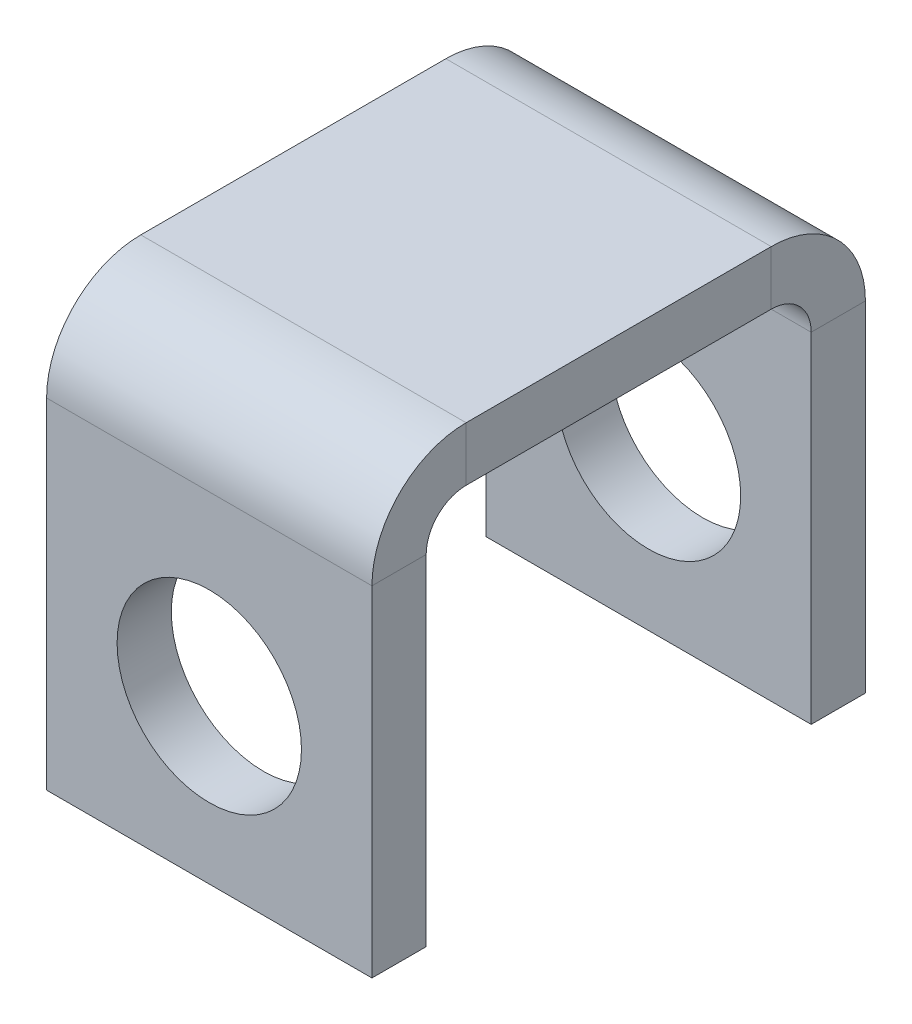
ISO-10303-21;
HEADER;
FILE_DESCRIPTION(('STEP AP214'),'2;1');
FILE_NAME('part.step','',(''),(''),'','','');
FILE_SCHEMA(('AUTOMOTIVE_DESIGN { 1 0 10303 214 1 1 1 1 }'));
ENDSEC;
DATA;
#1=APPLICATION_CONTEXT('core data for automotive mechanical design processes');
#2=APPLICATION_PROTOCOL_DEFINITION('international standard','automotive_design',2000,#1);
#3=PRODUCT_CONTEXT('',#1,'mechanical');
#4=PRODUCT('Part','Part','',(#3));
#5=PRODUCT_RELATED_PRODUCT_CATEGORY('part','',(#4));
#6=PRODUCT_DEFINITION_FORMATION('','',#4);
#7=PRODUCT_DEFINITION_CONTEXT('part definition',#1,'design');
#8=PRODUCT_DEFINITION('design','',#6,#7);
#9=PRODUCT_DEFINITION_SHAPE('','',#8);
#10=(LENGTH_UNIT() NAMED_UNIT(*) SI_UNIT(.MILLI.,.METRE.));
#11=(NAMED_UNIT(*) PLANE_ANGLE_UNIT() SI_UNIT($,.RADIAN.));
#12=(NAMED_UNIT(*) SI_UNIT($,.STERADIAN.) SOLID_ANGLE_UNIT());
#13=UNCERTAINTY_MEASURE_WITH_UNIT(LENGTH_MEASURE(1.E-05),#10,'distance_accuracy_value','');
#14=(GEOMETRIC_REPRESENTATION_CONTEXT(3) GLOBAL_UNCERTAINTY_ASSIGNED_CONTEXT((#13)) GLOBAL_UNIT_ASSIGNED_CONTEXT((#10,
#11,#12)) REPRESENTATION_CONTEXT('',''));
#15=CARTESIAN_POINT('',(0.,0.,0.));
#16=DIRECTION('',(0.,0.,1.));
#17=DIRECTION('',(1.,0.,0.));
#18=AXIS2_PLACEMENT_3D('',#15,#16,#17);
#19=CARTESIAN_POINT('',(0.,-1.,0.));
#20=DIRECTION('',(0.,-1.,0.));
#21=DIRECTION('',(0.,0.,-1.));
#22=AXIS2_PLACEMENT_3D('',#19,#20,#21);
#23=PLANE('',#22);
#24=DIRECTION('',(0.,0.,1.));
#25=VECTOR('',#24,1.);
#26=CARTESIAN_POINT('',(-3.,-1.,3.55));
#27=LINE('',#26,#25);
#28=CARTESIAN_POINT('',(-3.,-1.,-2.8134));
#29=VERTEX_POINT('',#28);
#30=CARTESIAN_POINT('',(-3.,-1.,2.8134));
#31=VERTEX_POINT('',#30);
#32=EDGE_CURVE('E11',#29,#31,#27,.T.);
#33=ORIENTED_EDGE('',*,*,#32,.F.);
#34=DIRECTION('',(1.,0.,0.));
#35=VECTOR('',#34,1.);
#36=CARTESIAN_POINT('',(3.,-1.,-2.8134));
#37=LINE('',#36,#35);
#38=CARTESIAN_POINT('',(3.,-1.,-2.8134));
#39=VERTEX_POINT('',#38);
#40=EDGE_CURVE('E189',#39,#29,#37,.F.);
#41=ORIENTED_EDGE('',*,*,#40,.F.);
#42=DIRECTION('',(0.,0.,-1.));
#43=VECTOR('',#42,1.);
#44=CARTESIAN_POINT('',(3.,-1.,3.55));
#45=LINE('',#44,#43);
#46=CARTESIAN_POINT('',(3.,-1.,2.8134));
#47=VERTEX_POINT('',#46);
#48=EDGE_CURVE('E49',#47,#39,#45,.T.);
#49=ORIENTED_EDGE('',*,*,#48,.F.);
#50=DIRECTION('',(-1.,0.,0.));
#51=VECTOR('',#50,1.);
#52=CARTESIAN_POINT('',(-3.,-0.999999999999998,2.8134));
#53=LINE('',#52,#51);
#54=EDGE_CURVE('E241',#31,#47,#53,.F.);
#55=ORIENTED_EDGE('',*,*,#54,.F.);
#56=EDGE_LOOP('',(#33,#41,#49,#55));
#57=FACE_BOUND('',#56,.T.);
#58=ADVANCED_FACE('F40',(#57),#23,.T.);
#59=CARTESIAN_POINT('',(0.,0.,0.));
#60=DIRECTION('',(0.,-1.,0.));
#61=DIRECTION('',(0.,0.,-1.));
#62=AXIS2_PLACEMENT_3D('',#59,#60,#61);
#63=PLANE('',#62);
#64=DIRECTION('',(1.,0.,0.));
#65=VECTOR('',#64,1.);
#66=CARTESIAN_POINT('',(3.,0.,-2.8134));
#67=LINE('',#66,#65);
#68=CARTESIAN_POINT('',(3.,0.,-2.8134));
#69=VERTEX_POINT('',#68);
#70=CARTESIAN_POINT('',(-3.,0.,-2.8134));
#71=VERTEX_POINT('',#70);
#72=EDGE_CURVE('E138',#69,#71,#67,.F.);
#73=ORIENTED_EDGE('',*,*,#72,.T.);
#74=DIRECTION('',(0.,0.,1.));
#75=VECTOR('',#74,1.);
#76=CARTESIAN_POINT('',(-3.,0.,3.55));
#77=LINE('',#76,#75);
#78=CARTESIAN_POINT('',(-3.,0.,2.8134));
#79=VERTEX_POINT('',#78);
#80=EDGE_CURVE('E249',#71,#79,#77,.T.);
#81=ORIENTED_EDGE('',*,*,#80,.T.);
#82=DIRECTION('',(-1.,0.,0.));
#83=VECTOR('',#82,1.);
#84=CARTESIAN_POINT('',(-3.,0.,2.8134));
#85=LINE('',#84,#83);
#86=CARTESIAN_POINT('',(3.,0.,2.8134));
#87=VERTEX_POINT('',#86);
#88=EDGE_CURVE('E229',#79,#87,#85,.F.);
#89=ORIENTED_EDGE('',*,*,#88,.T.);
#90=DIRECTION('',(0.,0.,-1.));
#91=VECTOR('',#90,1.);
#92=CARTESIAN_POINT('',(3.,0.,3.55));
#93=LINE('',#92,#91);
#94=EDGE_CURVE('E247',#87,#69,#93,.T.);
#95=ORIENTED_EDGE('',*,*,#94,.T.);
#96=EDGE_LOOP('',(#73,#81,#89,#95));
#97=FACE_BOUND('',#96,.T.);
#98=ADVANCED_FACE('F255',(#97),#63,.F.);
#99=CARTESIAN_POINT('',(3.,-1.,3.55));
#100=DIRECTION('',(1.,0.,0.));
#101=DIRECTION('',(0.,0.,-1.));
#102=AXIS2_PLACEMENT_3D('',#99,#100,#101);
#103=PLANE('',#102);
#104=ORIENTED_EDGE('',*,*,#48,.T.);
#105=DIRECTION('',(0.,1.,0.));
#106=VECTOR('',#105,1.);
#107=CARTESIAN_POINT('',(3.,-1.,-2.8134));
#108=LINE('',#107,#106);
#109=EDGE_CURVE('E185',#39,#69,#108,.T.);
#110=ORIENTED_EDGE('',*,*,#109,.T.);
#111=ORIENTED_EDGE('',*,*,#94,.F.);
#112=DIRECTION('',(0.,1.,0.));
#113=VECTOR('',#112,1.);
#114=CARTESIAN_POINT('',(3.,-0.999999999999998,2.8134));
#115=LINE('',#114,#113);
#116=EDGE_CURVE('E63',#47,#87,#115,.T.);
#117=ORIENTED_EDGE('',*,*,#116,.F.);
#118=EDGE_LOOP('',(#104,#110,#111,#117));
#119=FACE_BOUND('',#118,.T.);
#120=ADVANCED_FACE('F42',(#119),#103,.T.);
#121=CARTESIAN_POINT('',(-3.,-1.,3.55));
#122=DIRECTION('',(-1.,0.,0.));
#123=DIRECTION('',(0.,0.,1.));
#124=AXIS2_PLACEMENT_3D('',#121,#122,#123);
#125=PLANE('',#124);
#126=DIRECTION('',(0.,1.,0.));
#127=VECTOR('',#126,1.);
#128=CARTESIAN_POINT('',(-3.,-1.,-2.8134));
#129=LINE('',#128,#127);
#130=EDGE_CURVE('E193',#29,#71,#129,.T.);
#131=ORIENTED_EDGE('',*,*,#130,.F.);
#132=ORIENTED_EDGE('',*,*,#32,.T.);
#133=DIRECTION('',(0.,1.,0.));
#134=VECTOR('',#133,1.);
#135=CARTESIAN_POINT('',(-3.,-0.999999999999998,2.8134));
#136=LINE('',#135,#134);
#137=EDGE_CURVE('E235',#31,#79,#136,.T.);
#138=ORIENTED_EDGE('',*,*,#137,.T.);
#139=ORIENTED_EDGE('',*,*,#80,.F.);
#140=EDGE_LOOP('',(#131,#132,#138,#139));
#141=FACE_BOUND('',#140,.T.);
#142=ADVANCED_FACE('F311',(#141),#125,.T.);
#143=CARTESIAN_POINT('',(3.,-1.7366,2.8134));
#144=DIRECTION('',(1.,0.,0.));
#145=DIRECTION('',(0.,0.,-1.));
#146=AXIS2_PLACEMENT_3D('',#143,#144,#145);
#147=PLANE('',#146);
#148=DIRECTION('',(0.,0.,1.));
#149=VECTOR('',#148,1.);
#150=CARTESIAN_POINT('',(3.,-1.7366,3.55));
#151=LINE('',#150,#149);
#152=CARTESIAN_POINT('',(3.,-1.7366,3.55));
#153=VERTEX_POINT('',#152);
#154=CARTESIAN_POINT('',(3.,-1.73659999999999,4.55));
#155=VERTEX_POINT('',#154);
#156=EDGE_CURVE('E196',#153,#155,#151,.T.);
#157=ORIENTED_EDGE('',*,*,#156,.F.);
#158=CARTESIAN_POINT('',(3.,-1.7366,2.8134));
#159=DIRECTION('',(-1.,0.,0.));
#160=DIRECTION('',(0.,0.,1.));
#161=AXIS2_PLACEMENT_3D('',#158,#159,#160);
#162=CIRCLE('',#161,0.7366);
#163=EDGE_CURVE('E238',#47,#153,#162,.F.);
#164=ORIENTED_EDGE('',*,*,#163,.F.);
#165=ORIENTED_EDGE('',*,*,#116,.T.);
#166=CARTESIAN_POINT('',(3.,-1.7366,2.8134));
#167=DIRECTION('',(-1.,0.,0.));
#168=DIRECTION('',(0.,0.,1.));
#169=AXIS2_PLACEMENT_3D('',#166,#167,#168);
#170=CIRCLE('',#169,1.7366);
#171=EDGE_CURVE('E231',#87,#155,#170,.F.);
#172=ORIENTED_EDGE('',*,*,#171,.T.);
#173=EDGE_LOOP('',(#157,#164,#165,#172));
#174=FACE_BOUND('',#173,.T.);
#175=ADVANCED_FACE('F283',(#174),#147,.T.);
#176=CARTESIAN_POINT('',(-3.,-1.7366,2.8134));
#177=DIRECTION('',(1.,0.,0.));
#178=DIRECTION('',(0.,0.,-1.));
#179=AXIS2_PLACEMENT_3D('',#176,#177,#178);
#180=PLANE('',#179);
#181=CARTESIAN_POINT('',(-3.,-1.7366,2.8134));
#182=DIRECTION('',(-1.,0.,0.));
#183=DIRECTION('',(0.,0.,1.));
#184=AXIS2_PLACEMENT_3D('',#181,#182,#183);
#185=CIRCLE('',#184,0.7366);
#186=CARTESIAN_POINT('',(-3.,-1.7366,3.55));
#187=VERTEX_POINT('',#186);
#188=EDGE_CURVE('E228',#187,#31,#185,.T.);
#189=ORIENTED_EDGE('',*,*,#188,.F.);
#190=DIRECTION('',(0.,0.,1.));
#191=VECTOR('',#190,1.);
#192=CARTESIAN_POINT('',(-3.,-1.7366,3.55));
#193=LINE('',#192,#191);
#194=CARTESIAN_POINT('',(-3.,-1.7366,4.55));
#195=VERTEX_POINT('',#194);
#196=EDGE_CURVE('E201',#187,#195,#193,.T.);
#197=ORIENTED_EDGE('',*,*,#196,.T.);
#198=CARTESIAN_POINT('',(-3.,-1.7366,2.8134));
#199=DIRECTION('',(-1.,0.,0.));
#200=DIRECTION('',(0.,0.,1.));
#201=AXIS2_PLACEMENT_3D('',#198,#199,#200);
#202=CIRCLE('',#201,1.7366);
#203=EDGE_CURVE('E232',#195,#79,#202,.T.);
#204=ORIENTED_EDGE('',*,*,#203,.T.);
#205=ORIENTED_EDGE('',*,*,#137,.F.);
#206=EDGE_LOOP('',(#189,#197,#204,#205));
#207=FACE_BOUND('',#206,.T.);
#208=ADVANCED_FACE('F262',(#207),#180,.F.);
#209=CARTESIAN_POINT('',(-3.,-1.7366,2.8134));
#210=DIRECTION('',(-1.,0.,0.));
#211=DIRECTION('',(0.,0.,1.));
#212=AXIS2_PLACEMENT_3D('',#209,#210,#211);
#213=CYLINDRICAL_SURFACE('',#212,1.7366);
#214=ORIENTED_EDGE('',*,*,#88,.F.);
#215=ORIENTED_EDGE('',*,*,#203,.F.);
#216=DIRECTION('',(1.,0.,0.));
#217=VECTOR('',#216,1.);
#218=CARTESIAN_POINT('',(0.,-1.7366,4.55));
#219=LINE('',#218,#217);
#220=EDGE_CURVE('E204',#195,#155,#219,.T.);
#221=ORIENTED_EDGE('',*,*,#220,.T.);
#222=ORIENTED_EDGE('',*,*,#171,.F.);
#223=EDGE_LOOP('',(#214,#215,#221,#222));
#224=FACE_BOUND('',#223,.T.);
#225=ADVANCED_FACE('F258',(#224),#213,.T.);
#226=CARTESIAN_POINT('',(-3.,-1.7366,2.8134));
#227=DIRECTION('',(-1.,0.,0.));
#228=DIRECTION('',(0.,0.,1.));
#229=AXIS2_PLACEMENT_3D('',#226,#227,#228);
#230=CYLINDRICAL_SURFACE('',#229,0.7366);
#231=ORIENTED_EDGE('',*,*,#54,.T.);
#232=ORIENTED_EDGE('',*,*,#163,.T.);
#233=DIRECTION('',(-1.,0.,0.));
#234=VECTOR('',#233,1.);
#235=CARTESIAN_POINT('',(3.,-1.7366,3.55));
#236=LINE('',#235,#234);
#237=EDGE_CURVE('E199',#153,#187,#236,.T.);
#238=ORIENTED_EDGE('',*,*,#237,.T.);
#239=ORIENTED_EDGE('',*,*,#188,.T.);
#240=EDGE_LOOP('',(#231,#232,#238,#239));
#241=FACE_BOUND('',#240,.T.);
#242=ADVANCED_FACE('F286',(#241),#230,.F.);
#243=CARTESIAN_POINT('',(-3.,-8.,4.55000000000002));
#244=DIRECTION('',(1.,0.,0.));
#245=DIRECTION('',(0.,0.,-1.));
#246=AXIS2_PLACEMENT_3D('',#243,#244,#245);
#247=PLANE('',#246);
#248=ORIENTED_EDGE('',*,*,#196,.F.);
#249=DIRECTION('',(0.,-1.,0.));
#250=VECTOR('',#249,1.);
#251=CARTESIAN_POINT('',(-3.,-8.,3.55000000000002));
#252=LINE('',#251,#250);
#253=CARTESIAN_POINT('',(-3.,-8.,3.55000000000002));
#254=VERTEX_POINT('',#253);
#255=EDGE_CURVE('E208',#187,#254,#252,.T.);
#256=ORIENTED_EDGE('',*,*,#255,.T.);
#257=DIRECTION('',(0.,0.,-1.));
#258=VECTOR('',#257,1.);
#259=CARTESIAN_POINT('',(-3.,-8.,4.55000000000002));
#260=LINE('',#259,#258);
#261=CARTESIAN_POINT('',(-3.,-8.,4.55000000000002));
#262=VERTEX_POINT('',#261);
#263=EDGE_CURVE('E225',#262,#254,#260,.T.);
#264=ORIENTED_EDGE('',*,*,#263,.F.);
#265=DIRECTION('',(0.,-1.,0.));
#266=VECTOR('',#265,1.);
#267=CARTESIAN_POINT('',(-3.,-8.,4.55000000000002));
#268=LINE('',#267,#266);
#269=EDGE_CURVE('E209',#195,#262,#268,.T.);
#270=ORIENTED_EDGE('',*,*,#269,.F.);
#271=EDGE_LOOP('',(#248,#256,#264,#270));
#272=FACE_BOUND('',#271,.T.);
#273=ADVANCED_FACE('F272',(#272),#247,.F.);
#274=CARTESIAN_POINT('',(3.,-0.999999999999997,4.55));
#275=DIRECTION('',(-1.,0.,0.));
#276=DIRECTION('',(0.,0.,1.));
#277=AXIS2_PLACEMENT_3D('',#274,#275,#276);
#278=PLANE('',#277);
#279=ORIENTED_EDGE('',*,*,#156,.T.);
#280=DIRECTION('',(0.,1.,0.));
#281=VECTOR('',#280,1.);
#282=CARTESIAN_POINT('',(3.,-0.999999999999997,4.55));
#283=LINE('',#282,#281);
#284=CARTESIAN_POINT('',(3.,-8.,4.55000000000002));
#285=VERTEX_POINT('',#284);
#286=EDGE_CURVE('E214',#285,#155,#283,.T.);
#287=ORIENTED_EDGE('',*,*,#286,.F.);
#288=DIRECTION('',(0.,0.,-1.));
#289=VECTOR('',#288,1.);
#290=CARTESIAN_POINT('',(3.,-8.,4.55000000000002));
#291=LINE('',#290,#289);
#292=CARTESIAN_POINT('',(3.,-8.,3.55000000000002));
#293=VERTEX_POINT('',#292);
#294=EDGE_CURVE('E217',#285,#293,#291,.T.);
#295=ORIENTED_EDGE('',*,*,#294,.T.);
#296=DIRECTION('',(0.,1.,0.));
#297=VECTOR('',#296,1.);
#298=CARTESIAN_POINT('',(3.,-1.,3.55));
#299=LINE('',#298,#297);
#300=EDGE_CURVE('E212',#293,#153,#299,.T.);
#301=ORIENTED_EDGE('',*,*,#300,.T.);
#302=EDGE_LOOP('',(#279,#287,#295,#301));
#303=FACE_BOUND('',#302,.T.);
#304=ADVANCED_FACE('F280',(#303),#278,.F.);
#305=CARTESIAN_POINT('',(0.,0.,4.55));
#306=DIRECTION('',(0.,0.,-1.));
#307=DIRECTION('',(0.,1.,0.));
#308=AXIS2_PLACEMENT_3D('',#305,#306,#307);
#309=PLANE('',#308);
#310=CARTESIAN_POINT('',(0.,-5.,4.55));
#311=DIRECTION('',(0.,0.,1.));
#312=DIRECTION('',(1.,0.,0.));
#313=AXIS2_PLACEMENT_3D('',#310,#311,#312);
#314=CIRCLE('',#313,1.7);
#315=CARTESIAN_POINT('',(1.7,-5.,4.55));
#316=VERTEX_POINT('',#315);
#317=EDGE_CURVE('E330',#316,#316,#314,.T.);
#318=ORIENTED_EDGE('',*,*,#317,.F.);
#319=EDGE_LOOP('',(#318));
#320=FACE_BOUND('',#319,.T.);
#321=ORIENTED_EDGE('',*,*,#220,.F.);
#322=ORIENTED_EDGE('',*,*,#269,.T.);
#323=DIRECTION('',(1.,0.,0.));
#324=VECTOR('',#323,1.);
#325=CARTESIAN_POINT('',(3.,-8.,4.55000000000002));
#326=LINE('',#325,#324);
#327=EDGE_CURVE('E211',#262,#285,#326,.T.);
#328=ORIENTED_EDGE('',*,*,#327,.T.);
#329=ORIENTED_EDGE('',*,*,#286,.T.);
#330=EDGE_LOOP('',(#321,#322,#328,#329));
#331=FACE_BOUND('',#330,.T.);
#332=ADVANCED_FACE('F269',(#320,#331),#309,.F.);
#333=CARTESIAN_POINT('',(0.,0.,3.55));
#334=DIRECTION('',(0.,0.,-1.));
#335=DIRECTION('',(0.,1.,0.));
#336=AXIS2_PLACEMENT_3D('',#333,#334,#335);
#337=PLANE('',#336);
#338=CARTESIAN_POINT('',(0.,-5.,3.55000000000001));
#339=DIRECTION('',(0.,0.,-1.));
#340=DIRECTION('',(0.,1.,0.));
#341=AXIS2_PLACEMENT_3D('',#338,#339,#340);
#342=CIRCLE('',#341,1.7);
#343=CARTESIAN_POINT('',(0.,-3.3,3.55000000000001));
#344=VERTEX_POINT('',#343);
#345=EDGE_CURVE('E325',#344,#344,#342,.T.);
#346=ORIENTED_EDGE('',*,*,#345,.F.);
#347=EDGE_LOOP('',(#346));
#348=FACE_BOUND('',#347,.T.);
#349=ORIENTED_EDGE('',*,*,#255,.F.);
#350=ORIENTED_EDGE('',*,*,#237,.F.);
#351=ORIENTED_EDGE('',*,*,#300,.F.);
#352=DIRECTION('',(1.,0.,0.));
#353=VECTOR('',#352,1.);
#354=CARTESIAN_POINT('',(3.,-8.,3.55000000000002));
#355=LINE('',#354,#353);
#356=EDGE_CURVE('E219',#254,#293,#355,.T.);
#357=ORIENTED_EDGE('',*,*,#356,.F.);
#358=EDGE_LOOP('',(#349,#350,#351,#357));
#359=FACE_BOUND('',#358,.T.);
#360=ADVANCED_FACE('F288',(#348,#359),#337,.T.);
#361=CARTESIAN_POINT('',(3.,-8.,4.55000000000002));
#362=DIRECTION('',(0.,1.,0.));
#363=DIRECTION('',(0.,0.,1.));
#364=AXIS2_PLACEMENT_3D('',#361,#362,#363);
#365=PLANE('',#364);
#366=ORIENTED_EDGE('',*,*,#356,.T.);
#367=ORIENTED_EDGE('',*,*,#294,.F.);
#368=ORIENTED_EDGE('',*,*,#327,.F.);
#369=ORIENTED_EDGE('',*,*,#263,.T.);
#370=EDGE_LOOP('',(#366,#367,#368,#369));
#371=FACE_BOUND('',#370,.T.);
#372=ADVANCED_FACE('F277',(#371),#365,.F.);
#373=CARTESIAN_POINT('',(-3.,-1.7366,-2.8134));
#374=DIRECTION('',(-1.,0.,0.));
#375=DIRECTION('',(0.,-1.,0.));
#376=AXIS2_PLACEMENT_3D('',#373,#374,#375);
#377=PLANE('',#376);
#378=DIRECTION('',(0.,0.,-1.));
#379=VECTOR('',#378,1.);
#380=CARTESIAN_POINT('',(-3.,-1.7366,-3.55));
#381=LINE('',#380,#379);
#382=CARTESIAN_POINT('',(-3.,-1.7366,-3.55));
#383=VERTEX_POINT('',#382);
#384=CARTESIAN_POINT('',(-3.,-1.7366,-4.55));
#385=VERTEX_POINT('',#384);
#386=EDGE_CURVE('E323',#383,#385,#381,.T.);
#387=ORIENTED_EDGE('',*,*,#386,.F.);
#388=CARTESIAN_POINT('',(-3.,-1.7366,-2.8134));
#389=DIRECTION('',(1.,0.,0.));
#390=DIRECTION('',(0.,1.,0.));
#391=AXIS2_PLACEMENT_3D('',#388,#389,#390);
#392=CIRCLE('',#391,0.7366);
#393=EDGE_CURVE('E141',#29,#383,#392,.F.);
#394=ORIENTED_EDGE('',*,*,#393,.F.);
#395=ORIENTED_EDGE('',*,*,#130,.T.);
#396=CARTESIAN_POINT('',(-3.,-1.7366,-2.8134));
#397=DIRECTION('',(1.,0.,0.));
#398=DIRECTION('',(0.,1.,0.));
#399=AXIS2_PLACEMENT_3D('',#396,#397,#398);
#400=CIRCLE('',#399,1.7366);
#401=EDGE_CURVE('E184',#71,#385,#400,.F.);
#402=ORIENTED_EDGE('',*,*,#401,.T.);
#403=EDGE_LOOP('',(#387,#394,#395,#402));
#404=FACE_BOUND('',#403,.T.);
#405=ADVANCED_FACE('F296',(#404),#377,.T.);
#406=CARTESIAN_POINT('',(3.,-1.7366,-2.8134));
#407=DIRECTION('',(-1.,0.,0.));
#408=DIRECTION('',(0.,-1.,0.));
#409=AXIS2_PLACEMENT_3D('',#406,#407,#408);
#410=PLANE('',#409);
#411=CARTESIAN_POINT('',(3.,-1.7366,-2.8134));
#412=DIRECTION('',(1.,0.,0.));
#413=DIRECTION('',(0.,1.,0.));
#414=AXIS2_PLACEMENT_3D('',#411,#412,#413);
#415=CIRCLE('',#414,0.7366);
#416=CARTESIAN_POINT('',(3.,-1.7366,-3.55));
#417=VERTEX_POINT('',#416);
#418=EDGE_CURVE('E148',#417,#39,#415,.T.);
#419=ORIENTED_EDGE('',*,*,#418,.F.);
#420=DIRECTION('',(0.,0.,-1.));
#421=VECTOR('',#420,1.);
#422=CARTESIAN_POINT('',(3.,-1.7366,-3.55));
#423=LINE('',#422,#421);
#424=CARTESIAN_POINT('',(3.,-1.73659999999999,-4.55));
#425=VERTEX_POINT('',#424);
#426=EDGE_CURVE('E145',#417,#425,#423,.T.);
#427=ORIENTED_EDGE('',*,*,#426,.T.);
#428=CARTESIAN_POINT('',(3.,-1.7366,-2.8134));
#429=DIRECTION('',(1.,0.,0.));
#430=DIRECTION('',(0.,1.,0.));
#431=AXIS2_PLACEMENT_3D('',#428,#429,#430);
#432=CIRCLE('',#431,1.7366);
#433=EDGE_CURVE('E131',#425,#69,#432,.T.);
#434=ORIENTED_EDGE('',*,*,#433,.T.);
#435=ORIENTED_EDGE('',*,*,#109,.F.);
#436=EDGE_LOOP('',(#419,#427,#434,#435));
#437=FACE_BOUND('',#436,.T.);
#438=ADVANCED_FACE('F146',(#437),#410,.F.);
#439=CARTESIAN_POINT('',(3.,-1.7366,-2.8134));
#440=DIRECTION('',(1.,0.,0.));
#441=DIRECTION('',(0.,0.,-1.));
#442=AXIS2_PLACEMENT_3D('',#439,#440,#441);
#443=CYLINDRICAL_SURFACE('',#442,1.7366);
#444=ORIENTED_EDGE('',*,*,#72,.F.);
#445=ORIENTED_EDGE('',*,*,#433,.F.);
#446=DIRECTION('',(-1.,0.,0.));
#447=VECTOR('',#446,1.);
#448=CARTESIAN_POINT('',(0.,-1.73659999999999,-4.55));
#449=LINE('',#448,#447);
#450=EDGE_CURVE('E136',#425,#385,#449,.T.);
#451=ORIENTED_EDGE('',*,*,#450,.T.);
#452=ORIENTED_EDGE('',*,*,#401,.F.);
#453=EDGE_LOOP('',(#444,#445,#451,#452));
#454=FACE_BOUND('',#453,.T.);
#455=ADVANCED_FACE('F133',(#454),#443,.T.);
#456=CARTESIAN_POINT('',(3.,-1.7366,-2.8134));
#457=DIRECTION('',(1.,0.,0.));
#458=DIRECTION('',(0.,0.,-1.));
#459=AXIS2_PLACEMENT_3D('',#456,#457,#458);
#460=CYLINDRICAL_SURFACE('',#459,0.7366);
#461=ORIENTED_EDGE('',*,*,#40,.T.);
#462=ORIENTED_EDGE('',*,*,#393,.T.);
#463=DIRECTION('',(1.,0.,0.));
#464=VECTOR('',#463,1.);
#465=CARTESIAN_POINT('',(-3.,-1.7366,-3.55));
#466=LINE('',#465,#464);
#467=EDGE_CURVE('E152',#383,#417,#466,.T.);
#468=ORIENTED_EDGE('',*,*,#467,.T.);
#469=ORIENTED_EDGE('',*,*,#418,.T.);
#470=EDGE_LOOP('',(#461,#462,#468,#469));
#471=FACE_BOUND('',#470,.T.);
#472=ADVANCED_FACE('F320',(#471),#460,.F.);
#473=CARTESIAN_POINT('',(3.,-8.,-4.55000000000002));
#474=DIRECTION('',(-1.,0.,0.));
#475=DIRECTION('',(0.,0.,1.));
#476=AXIS2_PLACEMENT_3D('',#473,#474,#475);
#477=PLANE('',#476);
#478=ORIENTED_EDGE('',*,*,#426,.F.);
#479=DIRECTION('',(0.,-1.,0.));
#480=VECTOR('',#479,1.);
#481=CARTESIAN_POINT('',(3.,-8.,-3.55000000000002));
#482=LINE('',#481,#480);
#483=CARTESIAN_POINT('',(3.,-8.,-3.55000000000002));
#484=VERTEX_POINT('',#483);
#485=EDGE_CURVE('E161',#417,#484,#482,.T.);
#486=ORIENTED_EDGE('',*,*,#485,.T.);
#487=DIRECTION('',(0.,0.,1.));
#488=VECTOR('',#487,1.);
#489=CARTESIAN_POINT('',(3.,-8.,-4.55000000000002));
#490=LINE('',#489,#488);
#491=CARTESIAN_POINT('',(3.,-8.,-4.55000000000002));
#492=VERTEX_POINT('',#491);
#493=EDGE_CURVE('E165',#492,#484,#490,.T.);
#494=ORIENTED_EDGE('',*,*,#493,.F.);
#495=DIRECTION('',(0.,-1.,0.));
#496=VECTOR('',#495,1.);
#497=CARTESIAN_POINT('',(3.,-8.,-4.55000000000002));
#498=LINE('',#497,#496);
#499=EDGE_CURVE('E157',#425,#492,#498,.T.);
#500=ORIENTED_EDGE('',*,*,#499,.F.);
#501=EDGE_LOOP('',(#478,#486,#494,#500));
#502=FACE_BOUND('',#501,.T.);
#503=ADVANCED_FACE('F163',(#502),#477,.F.);
#504=CARTESIAN_POINT('',(-3.,-0.999999999999997,-4.55));
#505=DIRECTION('',(1.,0.,0.));
#506=DIRECTION('',(0.,0.,-1.));
#507=AXIS2_PLACEMENT_3D('',#504,#505,#506);
#508=PLANE('',#507);
#509=ORIENTED_EDGE('',*,*,#386,.T.);
#510=DIRECTION('',(0.,1.,0.));
#511=VECTOR('',#510,1.);
#512=CARTESIAN_POINT('',(-3.,-0.999999999999997,-4.55));
#513=LINE('',#512,#511);
#514=CARTESIAN_POINT('',(-3.,-8.,-4.55000000000002));
#515=VERTEX_POINT('',#514);
#516=EDGE_CURVE('E160',#515,#385,#513,.T.);
#517=ORIENTED_EDGE('',*,*,#516,.F.);
#518=DIRECTION('',(0.,0.,1.));
#519=VECTOR('',#518,1.);
#520=CARTESIAN_POINT('',(-3.,-8.,-4.55000000000002));
#521=LINE('',#520,#519);
#522=CARTESIAN_POINT('',(-3.,-8.,-3.55000000000002));
#523=VERTEX_POINT('',#522);
#524=EDGE_CURVE('E177',#515,#523,#521,.T.);
#525=ORIENTED_EDGE('',*,*,#524,.T.);
#526=DIRECTION('',(0.,1.,0.));
#527=VECTOR('',#526,1.);
#528=CARTESIAN_POINT('',(-3.,-1.,-3.55));
#529=LINE('',#528,#527);
#530=EDGE_CURVE('E168',#523,#383,#529,.T.);
#531=ORIENTED_EDGE('',*,*,#530,.T.);
#532=EDGE_LOOP('',(#509,#517,#525,#531));
#533=FACE_BOUND('',#532,.T.);
#534=ADVANCED_FACE('F352',(#533),#508,.F.);
#535=CARTESIAN_POINT('',(0.,0.,-4.55));
#536=DIRECTION('',(0.,0.,1.));
#537=DIRECTION('',(0.,-1.,0.));
#538=AXIS2_PLACEMENT_3D('',#535,#536,#537);
#539=PLANE('',#538);
#540=CARTESIAN_POINT('',(0.,-5.,-4.55000000000002));
#541=DIRECTION('',(0.,0.,1.));
#542=DIRECTION('',(1.,0.,0.));
#543=AXIS2_PLACEMENT_3D('',#540,#541,#542);
#544=CIRCLE('',#543,1.7);
#545=CARTESIAN_POINT('',(1.7,-5.,-4.55000000000002));
#546=VERTEX_POINT('',#545);
#547=EDGE_CURVE('E333',#546,#546,#544,.T.);
#548=ORIENTED_EDGE('',*,*,#547,.T.);
#549=EDGE_LOOP('',(#548));
#550=FACE_BOUND('',#549,.T.);
#551=ORIENTED_EDGE('',*,*,#450,.F.);
#552=ORIENTED_EDGE('',*,*,#499,.T.);
#553=DIRECTION('',(-1.,0.,0.));
#554=VECTOR('',#553,1.);
#555=CARTESIAN_POINT('',(-3.,-8.,-4.55000000000002));
#556=LINE('',#555,#554);
#557=EDGE_CURVE('E167',#492,#515,#556,.T.);
#558=ORIENTED_EDGE('',*,*,#557,.T.);
#559=ORIENTED_EDGE('',*,*,#516,.T.);
#560=EDGE_LOOP('',(#551,#552,#558,#559));
#561=FACE_BOUND('',#560,.T.);
#562=ADVANCED_FACE('F156',(#550,#561),#539,.F.);
#563=CARTESIAN_POINT('',(0.,0.,-3.55));
#564=DIRECTION('',(0.,0.,1.));
#565=DIRECTION('',(0.,-1.,0.));
#566=AXIS2_PLACEMENT_3D('',#563,#564,#565);
#567=PLANE('',#566);
#568=CARTESIAN_POINT('',(0.,-5.,-3.55000000000001));
#569=DIRECTION('',(0.,0.,1.));
#570=DIRECTION('',(0.,-1.,0.));
#571=AXIS2_PLACEMENT_3D('',#568,#569,#570);
#572=CIRCLE('',#571,1.7);
#573=CARTESIAN_POINT('',(0.,-6.7,-3.55000000000002));
#574=VERTEX_POINT('',#573);
#575=EDGE_CURVE('E44',#574,#574,#572,.T.);
#576=ORIENTED_EDGE('',*,*,#575,.F.);
#577=EDGE_LOOP('',(#576));
#578=FACE_BOUND('',#577,.T.);
#579=ORIENTED_EDGE('',*,*,#485,.F.);
#580=ORIENTED_EDGE('',*,*,#467,.F.);
#581=ORIENTED_EDGE('',*,*,#530,.F.);
#582=DIRECTION('',(-1.,0.,0.));
#583=VECTOR('',#582,1.);
#584=CARTESIAN_POINT('',(-3.,-8.,-3.55000000000002));
#585=LINE('',#584,#583);
#586=EDGE_CURVE('E172',#484,#523,#585,.T.);
#587=ORIENTED_EDGE('',*,*,#586,.F.);
#588=EDGE_LOOP('',(#579,#580,#581,#587));
#589=FACE_BOUND('',#588,.T.);
#590=ADVANCED_FACE('F343',(#578,#589),#567,.T.);
#591=CARTESIAN_POINT('',(-3.,-8.,-4.55000000000002));
#592=DIRECTION('',(0.,1.,0.));
#593=DIRECTION('',(0.,0.,1.));
#594=AXIS2_PLACEMENT_3D('',#591,#592,#593);
#595=PLANE('',#594);
#596=ORIENTED_EDGE('',*,*,#586,.T.);
#597=ORIENTED_EDGE('',*,*,#524,.F.);
#598=ORIENTED_EDGE('',*,*,#557,.F.);
#599=ORIENTED_EDGE('',*,*,#493,.T.);
#600=EDGE_LOOP('',(#596,#597,#598,#599));
#601=FACE_BOUND('',#600,.T.);
#602=ADVANCED_FACE('F346',(#601),#595,.F.);
#603=CARTESIAN_POINT('',(0.,-5.,-4.55000000000002));
#604=DIRECTION('',(0.,0.,1.));
#605=DIRECTION('',(1.,0.,0.));
#606=AXIS2_PLACEMENT_3D('',#603,#604,#605);
#607=CYLINDRICAL_SURFACE('',#606,1.7);
#608=ORIENTED_EDGE('',*,*,#575,.T.);
#609=EDGE_LOOP('',(#608));
#610=FACE_BOUND('',#609,.T.);
#611=ORIENTED_EDGE('',*,*,#547,.F.);
#612=EDGE_LOOP('',(#611));
#613=FACE_BOUND('',#612,.T.);
#614=ADVANCED_FACE('F340',(#610,#613),#607,.F.);
#615=ORIENTED_EDGE('',*,*,#345,.T.);
#616=EDGE_LOOP('',(#615));
#617=FACE_BOUND('',#616,.T.);
#618=ORIENTED_EDGE('',*,*,#317,.T.);
#619=EDGE_LOOP('',(#618));
#620=FACE_BOUND('',#619,.T.);
#621=ADVANCED_FACE('F438',(#617,#620),#607,.F.);
#622=CLOSED_SHELL('',(#58,#98,#120,#142,#175,#208,#225,#242,#273,#304,#332,#360,#372,#405,#438,
#455,#472,#503,#534,#562,#590,#602,#614,#621));
#623=MANIFOLD_SOLID_BREP('B2',#622);
#624=ADVANCED_BREP_SHAPE_REPRESENTATION('',(#18,#623),#14);
#625=SHAPE_DEFINITION_REPRESENTATION(#9,#624);
ENDSEC;
END-ISO-10303-21;
